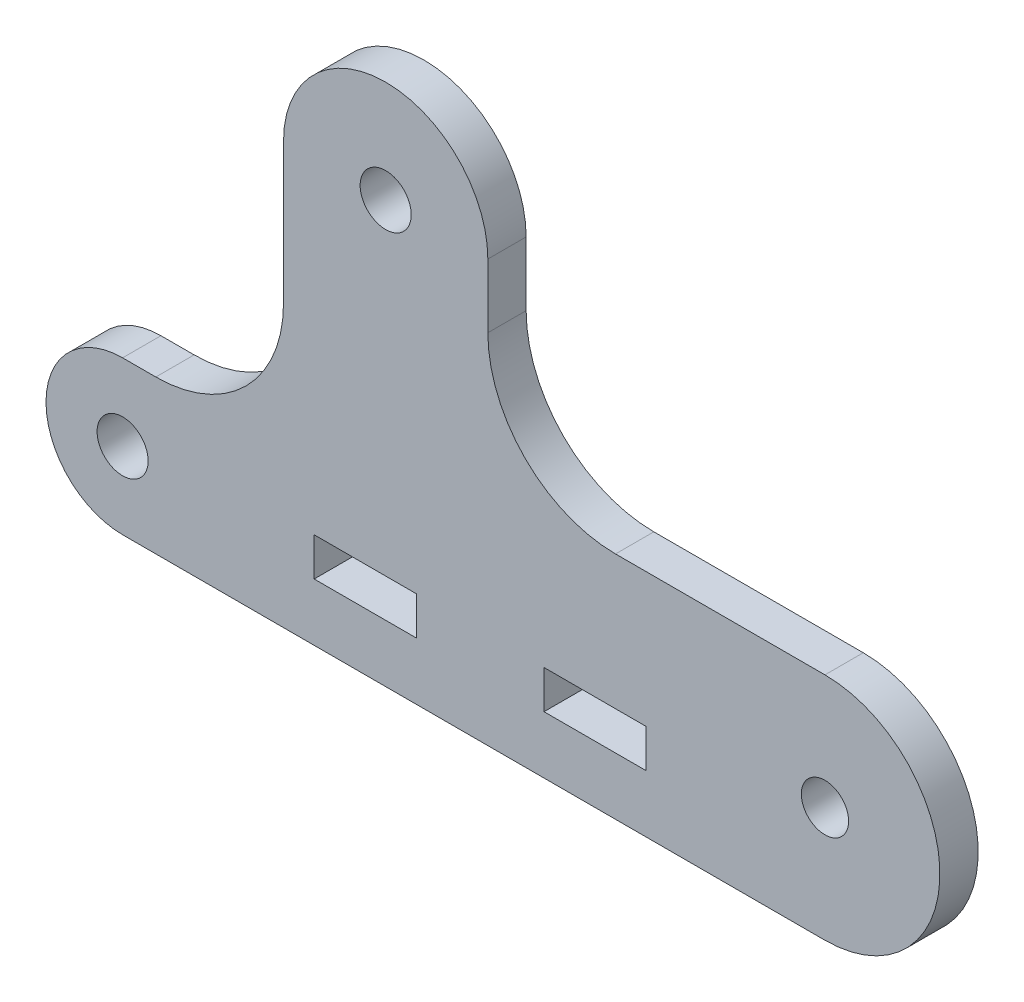
ISO-10303-21;
HEADER;
FILE_DESCRIPTION(('STEP AP214'),'2;1');
FILE_NAME('part.step','',(''),(''),'','','');
FILE_SCHEMA(('AUTOMOTIVE_DESIGN { 1 0 10303 214 1 1 1 1 }'));
ENDSEC;
DATA;
#1=APPLICATION_CONTEXT('core data for automotive mechanical design processes');
#2=APPLICATION_PROTOCOL_DEFINITION('international standard','automotive_design',2000,#1);
#3=PRODUCT_CONTEXT('',#1,'mechanical');
#4=PRODUCT('Part','Part','',(#3));
#5=PRODUCT_RELATED_PRODUCT_CATEGORY('part','',(#4));
#6=PRODUCT_DEFINITION_FORMATION('','',#4);
#7=PRODUCT_DEFINITION_CONTEXT('part definition',#1,'design');
#8=PRODUCT_DEFINITION('design','',#6,#7);
#9=PRODUCT_DEFINITION_SHAPE('','',#8);
#10=(LENGTH_UNIT() NAMED_UNIT(*) SI_UNIT(.MILLI.,.METRE.));
#11=(NAMED_UNIT(*) PLANE_ANGLE_UNIT() SI_UNIT($,.RADIAN.));
#12=(NAMED_UNIT(*) SI_UNIT($,.STERADIAN.) SOLID_ANGLE_UNIT());
#13=UNCERTAINTY_MEASURE_WITH_UNIT(LENGTH_MEASURE(1.E-05),#10,'distance_accuracy_value','');
#14=(GEOMETRIC_REPRESENTATION_CONTEXT(3) GLOBAL_UNCERTAINTY_ASSIGNED_CONTEXT((#13)) GLOBAL_UNIT_ASSIGNED_CONTEXT((#10,
#11,#12)) REPRESENTATION_CONTEXT('',''));
#15=CARTESIAN_POINT('',(0.,0.,0.));
#16=DIRECTION('',(0.,0.,1.));
#17=DIRECTION('',(1.,0.,0.));
#18=AXIS2_PLACEMENT_3D('',#15,#16,#17);
#19=CARTESIAN_POINT('',(-27.5,6.,1.5));
#20=DIRECTION('',(0.,0.,-1.));
#21=DIRECTION('',(-1.,0.,0.));
#22=AXIS2_PLACEMENT_3D('',#19,#20,#21);
#23=PLANE('',#22);
#24=DIRECTION('',(0.,-1.,0.));
#25=VECTOR('',#24,1.);
#26=CARTESIAN_POINT('',(-12.5,7.5,1.5));
#27=LINE('',#26,#25);
#28=CARTESIAN_POINT('',(-12.5,7.5,1.5));
#29=VERTEX_POINT('',#28);
#30=CARTESIAN_POINT('',(-12.5,4.5,1.5));
#31=VERTEX_POINT('',#30);
#32=EDGE_CURVE('E194',#29,#31,#27,.T.);
#33=ORIENTED_EDGE('',*,*,#32,.F.);
#34=DIRECTION('',(-1.,0.,0.));
#35=VECTOR('',#34,1.);
#36=CARTESIAN_POINT('',(-12.5,7.5,1.5));
#37=LINE('',#36,#35);
#38=CARTESIAN_POINT('',(-4.5,7.5,1.5));
#39=VERTEX_POINT('',#38);
#40=EDGE_CURVE('E202',#39,#29,#37,.T.);
#41=ORIENTED_EDGE('',*,*,#40,.F.);
#42=DIRECTION('',(0.,1.,0.));
#43=VECTOR('',#42,1.);
#44=CARTESIAN_POINT('',(-4.5,7.5,1.5));
#45=LINE('',#44,#43);
#46=CARTESIAN_POINT('',(-4.5,4.5,1.5));
#47=VERTEX_POINT('',#46);
#48=EDGE_CURVE('E199',#47,#39,#45,.T.);
#49=ORIENTED_EDGE('',*,*,#48,.F.);
#50=DIRECTION('',(1.,0.,0.));
#51=VECTOR('',#50,1.);
#52=CARTESIAN_POINT('',(-12.5,4.5,1.5));
#53=LINE('',#52,#51);
#54=EDGE_CURVE('E196',#31,#47,#53,.T.);
#55=ORIENTED_EDGE('',*,*,#54,.F.);
#56=EDGE_LOOP('',(#33,#41,#49,#55));
#57=FACE_BOUND('',#56,.T.);
#58=CARTESIAN_POINT('',(-27.5,6.,1.5));
#59=DIRECTION('',(0.,0.,1.));
#60=DIRECTION('',(-1.,0.,0.));
#61=AXIS2_PLACEMENT_3D('',#58,#59,#60);
#62=CIRCLE('',#61,6.);
#63=CARTESIAN_POINT('',(-27.5,12.,1.5));
#64=VERTEX_POINT('',#63);
#65=CARTESIAN_POINT('',(-27.5,0.,1.5));
#66=VERTEX_POINT('',#65);
#67=EDGE_CURVE('E243',#64,#66,#62,.T.);
#68=ORIENTED_EDGE('',*,*,#67,.T.);
#69=DIRECTION('',(1.,0.,0.));
#70=VECTOR('',#69,1.);
#71=CARTESIAN_POINT('',(-27.5,0.,1.5));
#72=LINE('',#71,#70);
#73=CARTESIAN_POINT('',(27.5,0.,1.5));
#74=VERTEX_POINT('',#73);
#75=EDGE_CURVE('E246',#66,#74,#72,.T.);
#76=ORIENTED_EDGE('',*,*,#75,.T.);
#77=CARTESIAN_POINT('',(27.5,9.,1.5));
#78=DIRECTION('',(0.,0.,1.));
#79=DIRECTION('',(1.,0.,0.));
#80=AXIS2_PLACEMENT_3D('',#77,#78,#79);
#81=CIRCLE('',#80,9.);
#82=CARTESIAN_POINT('',(27.5,18.,1.5));
#83=VERTEX_POINT('',#82);
#84=EDGE_CURVE('E249',#74,#83,#81,.T.);
#85=ORIENTED_EDGE('',*,*,#84,.T.);
#86=DIRECTION('',(-1.,0.,0.));
#87=VECTOR('',#86,1.);
#88=CARTESIAN_POINT('',(11.1000000000001,18.,1.5));
#89=LINE('',#88,#87);
#90=CARTESIAN_POINT('',(11.1000000000001,18.,1.5));
#91=VERTEX_POINT('',#90);
#92=EDGE_CURVE('E251',#83,#91,#89,.T.);
#93=ORIENTED_EDGE('',*,*,#92,.T.);
#94=CARTESIAN_POINT('',(11.1,28.,1.5));
#95=DIRECTION('',(0.,0.,-1.));
#96=DIRECTION('',(1.,0.,0.));
#97=AXIS2_PLACEMENT_3D('',#94,#95,#96);
#98=CIRCLE('',#97,10.);
#99=CARTESIAN_POINT('',(1.09999999999999,28.0000000000001,1.5));
#100=VERTEX_POINT('',#99);
#101=EDGE_CURVE('E253',#91,#100,#98,.T.);
#102=ORIENTED_EDGE('',*,*,#101,.T.);
#103=DIRECTION('',(0.,1.,0.));
#104=VECTOR('',#103,1.);
#105=CARTESIAN_POINT('',(1.09999999999999,33.,1.5));
#106=LINE('',#105,#104);
#107=CARTESIAN_POINT('',(1.09999999999999,33.,1.5));
#108=VERTEX_POINT('',#107);
#109=EDGE_CURVE('E255',#100,#108,#106,.T.);
#110=ORIENTED_EDGE('',*,*,#109,.T.);
#111=CARTESIAN_POINT('',(-6.90000000000001,33.,1.5));
#112=DIRECTION('',(0.,0.,1.));
#113=DIRECTION('',(-1.,0.,0.));
#114=AXIS2_PLACEMENT_3D('',#111,#112,#113);
#115=CIRCLE('',#114,8.);
#116=CARTESIAN_POINT('',(-14.9,33.,1.5));
#117=VERTEX_POINT('',#116);
#118=EDGE_CURVE('E257',#108,#117,#115,.T.);
#119=ORIENTED_EDGE('',*,*,#118,.T.);
#120=DIRECTION('',(0.,-1.,0.));
#121=VECTOR('',#120,1.);
#122=CARTESIAN_POINT('',(-14.9,33.,1.5));
#123=LINE('',#122,#121);
#124=CARTESIAN_POINT('',(-14.9,22.0000000000001,1.5));
#125=VERTEX_POINT('',#124);
#126=EDGE_CURVE('E259',#117,#125,#123,.T.);
#127=ORIENTED_EDGE('',*,*,#126,.T.);
#128=CARTESIAN_POINT('',(-24.9,22.,1.5));
#129=DIRECTION('',(0.,0.,-1.));
#130=DIRECTION('',(-1.,0.,0.));
#131=AXIS2_PLACEMENT_3D('',#128,#129,#130);
#132=CIRCLE('',#131,10.);
#133=CARTESIAN_POINT('',(-24.9000000000001,12.,1.5));
#134=VERTEX_POINT('',#133);
#135=EDGE_CURVE('E261',#125,#134,#132,.T.);
#136=ORIENTED_EDGE('',*,*,#135,.T.);
#137=DIRECTION('',(-1.,0.,0.));
#138=VECTOR('',#137,1.);
#139=CARTESIAN_POINT('',(-24.9000000000001,12.,1.5));
#140=LINE('',#139,#138);
#141=EDGE_CURVE('E263',#134,#64,#140,.T.);
#142=ORIENTED_EDGE('',*,*,#141,.T.);
#143=EDGE_LOOP('',(#68,#76,#85,#93,#102,#110,#119,#127,#136,#142));
#144=FACE_BOUND('',#143,.T.);
#145=CARTESIAN_POINT('',(27.5,9.,1.5));
#146=DIRECTION('',(0.,0.,1.));
#147=DIRECTION('',(1.,0.,0.));
#148=AXIS2_PLACEMENT_3D('',#145,#146,#147);
#149=CIRCLE('',#148,1.85);
#150=CARTESIAN_POINT('',(29.35,9.,1.5));
#151=VERTEX_POINT('',#150);
#152=EDGE_CURVE('E237',#151,#151,#149,.T.);
#153=ORIENTED_EDGE('',*,*,#152,.F.);
#154=EDGE_LOOP('',(#153));
#155=FACE_BOUND('',#154,.T.);
#156=CARTESIAN_POINT('',(-27.5,6.,1.5));
#157=DIRECTION('',(0.,0.,1.));
#158=DIRECTION('',(1.,0.,0.));
#159=AXIS2_PLACEMENT_3D('',#156,#157,#158);
#160=CIRCLE('',#159,2.);
#161=CARTESIAN_POINT('',(-25.5,6.,1.5));
#162=VERTEX_POINT('',#161);
#163=EDGE_CURVE('E231',#162,#162,#160,.T.);
#164=ORIENTED_EDGE('',*,*,#163,.F.);
#165=EDGE_LOOP('',(#164));
#166=FACE_BOUND('',#165,.T.);
#167=CARTESIAN_POINT('',(-6.90000000000001,33.,1.5));
#168=DIRECTION('',(0.,0.,1.));
#169=DIRECTION('',(1.,0.,0.));
#170=AXIS2_PLACEMENT_3D('',#167,#168,#169);
#171=CIRCLE('',#170,2.);
#172=CARTESIAN_POINT('',(-4.90000000000001,33.,1.5));
#173=VERTEX_POINT('',#172);
#174=EDGE_CURVE('E225',#173,#173,#171,.T.);
#175=ORIENTED_EDGE('',*,*,#174,.F.);
#176=EDGE_LOOP('',(#175));
#177=FACE_BOUND('',#176,.T.);
#178=DIRECTION('',(0.,-1.,0.));
#179=VECTOR('',#178,1.);
#180=CARTESIAN_POINT('',(5.5,7.5,1.5));
#181=LINE('',#180,#179);
#182=CARTESIAN_POINT('',(5.5,7.5,1.5));
#183=VERTEX_POINT('',#182);
#184=CARTESIAN_POINT('',(5.5,4.5,1.5));
#185=VERTEX_POINT('',#184);
#186=EDGE_CURVE('E158',#183,#185,#181,.T.);
#187=ORIENTED_EDGE('',*,*,#186,.F.);
#188=DIRECTION('',(-1.,0.,0.));
#189=VECTOR('',#188,1.);
#190=CARTESIAN_POINT('',(5.5,7.5,1.5));
#191=LINE('',#190,#189);
#192=CARTESIAN_POINT('',(13.5,7.5,1.5));
#193=VERTEX_POINT('',#192);
#194=EDGE_CURVE('E180',#193,#183,#191,.T.);
#195=ORIENTED_EDGE('',*,*,#194,.F.);
#196=DIRECTION('',(0.,1.,0.));
#197=VECTOR('',#196,1.);
#198=CARTESIAN_POINT('',(13.5,7.5,1.5));
#199=LINE('',#198,#197);
#200=CARTESIAN_POINT('',(13.5,4.5,1.5));
#201=VERTEX_POINT('',#200);
#202=EDGE_CURVE('E178',#201,#193,#199,.T.);
#203=ORIENTED_EDGE('',*,*,#202,.F.);
#204=DIRECTION('',(1.,0.,0.));
#205=VECTOR('',#204,1.);
#206=CARTESIAN_POINT('',(5.5,4.5,1.5));
#207=LINE('',#206,#205);
#208=EDGE_CURVE('E166',#185,#201,#207,.T.);
#209=ORIENTED_EDGE('',*,*,#208,.F.);
#210=EDGE_LOOP('',(#187,#195,#203,#209));
#211=FACE_BOUND('',#210,.T.);
#212=ADVANCED_FACE('F33',(#57,#144,#155,#166,#177,#211),#23,.F.);
#213=CARTESIAN_POINT('',(-27.5,6.,-1.5));
#214=DIRECTION('',(0.,0.,-1.));
#215=DIRECTION('',(-1.,0.,0.));
#216=AXIS2_PLACEMENT_3D('',#213,#214,#215);
#217=PLANE('',#216);
#218=CARTESIAN_POINT('',(-27.5,6.,-1.5));
#219=DIRECTION('',(0.,0.,1.));
#220=DIRECTION('',(1.,0.,0.));
#221=AXIS2_PLACEMENT_3D('',#218,#219,#220);
#222=CIRCLE('',#221,2.);
#223=CARTESIAN_POINT('',(-25.5,6.,-1.5));
#224=VERTEX_POINT('',#223);
#225=EDGE_CURVE('E228',#224,#224,#222,.T.);
#226=ORIENTED_EDGE('',*,*,#225,.T.);
#227=EDGE_LOOP('',(#226));
#228=FACE_BOUND('',#227,.T.);
#229=CARTESIAN_POINT('',(-27.5,6.,-1.5));
#230=DIRECTION('',(0.,0.,1.));
#231=DIRECTION('',(-1.,0.,0.));
#232=AXIS2_PLACEMENT_3D('',#229,#230,#231);
#233=CIRCLE('',#232,6.);
#234=CARTESIAN_POINT('',(-27.5,12.,-1.5));
#235=VERTEX_POINT('',#234);
#236=CARTESIAN_POINT('',(-27.5,0.,-1.5));
#237=VERTEX_POINT('',#236);
#238=EDGE_CURVE('E240',#235,#237,#233,.T.);
#239=ORIENTED_EDGE('',*,*,#238,.F.);
#240=DIRECTION('',(-1.,0.,0.));
#241=VECTOR('',#240,1.);
#242=CARTESIAN_POINT('',(-24.9000000000001,12.,-1.5));
#243=LINE('',#242,#241);
#244=CARTESIAN_POINT('',(-24.9000000000001,12.,-1.5));
#245=VERTEX_POINT('',#244);
#246=EDGE_CURVE('E247',#245,#235,#243,.T.);
#247=ORIENTED_EDGE('',*,*,#246,.F.);
#248=CARTESIAN_POINT('',(-24.9,22.,-1.5));
#249=DIRECTION('',(0.,0.,-1.));
#250=DIRECTION('',(-1.,0.,0.));
#251=AXIS2_PLACEMENT_3D('',#248,#249,#250);
#252=CIRCLE('',#251,10.);
#253=CARTESIAN_POINT('',(-14.9,22.0000000000001,-1.5));
#254=VERTEX_POINT('',#253);
#255=EDGE_CURVE('E282',#254,#245,#252,.T.);
#256=ORIENTED_EDGE('',*,*,#255,.F.);
#257=DIRECTION('',(0.,-1.,0.));
#258=VECTOR('',#257,1.);
#259=CARTESIAN_POINT('',(-14.9,33.,-1.5));
#260=LINE('',#259,#258);
#261=CARTESIAN_POINT('',(-14.9,33.,-1.5));
#262=VERTEX_POINT('',#261);
#263=EDGE_CURVE('E280',#262,#254,#260,.T.);
#264=ORIENTED_EDGE('',*,*,#263,.F.);
#265=CARTESIAN_POINT('',(-6.90000000000001,33.,-1.5));
#266=DIRECTION('',(0.,0.,1.));
#267=DIRECTION('',(-1.,0.,0.));
#268=AXIS2_PLACEMENT_3D('',#265,#266,#267);
#269=CIRCLE('',#268,8.);
#270=CARTESIAN_POINT('',(1.09999999999999,33.,-1.5));
#271=VERTEX_POINT('',#270);
#272=EDGE_CURVE('E278',#271,#262,#269,.T.);
#273=ORIENTED_EDGE('',*,*,#272,.F.);
#274=DIRECTION('',(0.,1.,0.));
#275=VECTOR('',#274,1.);
#276=CARTESIAN_POINT('',(1.09999999999999,33.,-1.5));
#277=LINE('',#276,#275);
#278=CARTESIAN_POINT('',(1.09999999999999,28.0000000000001,-1.5));
#279=VERTEX_POINT('',#278);
#280=EDGE_CURVE('E276',#279,#271,#277,.T.);
#281=ORIENTED_EDGE('',*,*,#280,.F.);
#282=CARTESIAN_POINT('',(11.1,28.,-1.5));
#283=DIRECTION('',(0.,0.,-1.));
#284=DIRECTION('',(1.,0.,0.));
#285=AXIS2_PLACEMENT_3D('',#282,#283,#284);
#286=CIRCLE('',#285,10.);
#287=CARTESIAN_POINT('',(11.1000000000001,18.,-1.5));
#288=VERTEX_POINT('',#287);
#289=EDGE_CURVE('E274',#288,#279,#286,.T.);
#290=ORIENTED_EDGE('',*,*,#289,.F.);
#291=DIRECTION('',(-1.,0.,0.));
#292=VECTOR('',#291,1.);
#293=CARTESIAN_POINT('',(11.1000000000001,18.,-1.5));
#294=LINE('',#293,#292);
#295=CARTESIAN_POINT('',(27.5,18.,-1.5));
#296=VERTEX_POINT('',#295);
#297=EDGE_CURVE('E272',#296,#288,#294,.T.);
#298=ORIENTED_EDGE('',*,*,#297,.F.);
#299=CARTESIAN_POINT('',(27.5,9.,-1.5));
#300=DIRECTION('',(0.,0.,1.));
#301=DIRECTION('',(1.,0.,0.));
#302=AXIS2_PLACEMENT_3D('',#299,#300,#301);
#303=CIRCLE('',#302,9.);
#304=CARTESIAN_POINT('',(27.5,0.,-1.5));
#305=VERTEX_POINT('',#304);
#306=EDGE_CURVE('E270',#305,#296,#303,.T.);
#307=ORIENTED_EDGE('',*,*,#306,.F.);
#308=DIRECTION('',(1.,0.,0.));
#309=VECTOR('',#308,1.);
#310=CARTESIAN_POINT('',(-27.5,0.,-1.5));
#311=LINE('',#310,#309);
#312=EDGE_CURVE('E268',#237,#305,#311,.T.);
#313=ORIENTED_EDGE('',*,*,#312,.F.);
#314=EDGE_LOOP('',(#239,#247,#256,#264,#273,#281,#290,#298,#307,#313));
#315=FACE_BOUND('',#314,.T.);
#316=CARTESIAN_POINT('',(27.5,9.,-1.5));
#317=DIRECTION('',(0.,0.,1.));
#318=DIRECTION('',(1.,0.,0.));
#319=AXIS2_PLACEMENT_3D('',#316,#317,#318);
#320=CIRCLE('',#319,1.85);
#321=CARTESIAN_POINT('',(29.35,9.,-1.5));
#322=VERTEX_POINT('',#321);
#323=EDGE_CURVE('E234',#322,#322,#320,.T.);
#324=ORIENTED_EDGE('',*,*,#323,.T.);
#325=EDGE_LOOP('',(#324));
#326=FACE_BOUND('',#325,.T.);
#327=CARTESIAN_POINT('',(-6.90000000000001,33.,-1.5));
#328=DIRECTION('',(0.,0.,1.));
#329=DIRECTION('',(1.,0.,0.));
#330=AXIS2_PLACEMENT_3D('',#327,#328,#329);
#331=CIRCLE('',#330,2.);
#332=CARTESIAN_POINT('',(-4.90000000000001,33.,-1.5));
#333=VERTEX_POINT('',#332);
#334=EDGE_CURVE('E224',#333,#333,#331,.T.);
#335=ORIENTED_EDGE('',*,*,#334,.T.);
#336=EDGE_LOOP('',(#335));
#337=FACE_BOUND('',#336,.T.);
#338=DIRECTION('',(-1.,0.,0.));
#339=VECTOR('',#338,1.);
#340=CARTESIAN_POINT('',(-12.5,7.5,-1.5));
#341=LINE('',#340,#339);
#342=CARTESIAN_POINT('',(-4.5,7.5,-1.5));
#343=VERTEX_POINT('',#342);
#344=CARTESIAN_POINT('',(-12.5,7.5,-1.5));
#345=VERTEX_POINT('',#344);
#346=EDGE_CURVE('E197',#343,#345,#341,.T.);
#347=ORIENTED_EDGE('',*,*,#346,.T.);
#348=DIRECTION('',(0.,-1.,0.));
#349=VECTOR('',#348,1.);
#350=CARTESIAN_POINT('',(-12.5,7.5,-1.5));
#351=LINE('',#350,#349);
#352=CARTESIAN_POINT('',(-12.5,4.5,-1.5));
#353=VERTEX_POINT('',#352);
#354=EDGE_CURVE('E174',#345,#353,#351,.T.);
#355=ORIENTED_EDGE('',*,*,#354,.T.);
#356=DIRECTION('',(1.,0.,0.));
#357=VECTOR('',#356,1.);
#358=CARTESIAN_POINT('',(-12.5,4.5,-1.5));
#359=LINE('',#358,#357);
#360=CARTESIAN_POINT('',(-4.5,4.5,-1.5));
#361=VERTEX_POINT('',#360);
#362=EDGE_CURVE('E207',#353,#361,#359,.T.);
#363=ORIENTED_EDGE('',*,*,#362,.T.);
#364=DIRECTION('',(0.,1.,0.));
#365=VECTOR('',#364,1.);
#366=CARTESIAN_POINT('',(-4.5,7.5,-1.5));
#367=LINE('',#366,#365);
#368=EDGE_CURVE('E210',#361,#343,#367,.T.);
#369=ORIENTED_EDGE('',*,*,#368,.T.);
#370=EDGE_LOOP('',(#347,#355,#363,#369));
#371=FACE_BOUND('',#370,.T.);
#372=DIRECTION('',(-1.,0.,0.));
#373=VECTOR('',#372,1.);
#374=CARTESIAN_POINT('',(5.5,7.5,-1.5));
#375=LINE('',#374,#373);
#376=CARTESIAN_POINT('',(13.5,7.5,-1.5));
#377=VERTEX_POINT('',#376);
#378=CARTESIAN_POINT('',(5.5,7.5,-1.5));
#379=VERTEX_POINT('',#378);
#380=EDGE_CURVE('E167',#377,#379,#375,.T.);
#381=ORIENTED_EDGE('',*,*,#380,.T.);
#382=DIRECTION('',(0.,-1.,0.));
#383=VECTOR('',#382,1.);
#384=CARTESIAN_POINT('',(5.5,7.5,-1.5));
#385=LINE('',#384,#383);
#386=CARTESIAN_POINT('',(5.5,4.5,-1.5));
#387=VERTEX_POINT('',#386);
#388=EDGE_CURVE('E56',#379,#387,#385,.T.);
#389=ORIENTED_EDGE('',*,*,#388,.T.);
#390=DIRECTION('',(1.,0.,0.));
#391=VECTOR('',#390,1.);
#392=CARTESIAN_POINT('',(5.5,4.5,-1.5));
#393=LINE('',#392,#391);
#394=CARTESIAN_POINT('',(13.5,4.5,-1.5));
#395=VERTEX_POINT('',#394);
#396=EDGE_CURVE('E173',#387,#395,#393,.T.);
#397=ORIENTED_EDGE('',*,*,#396,.T.);
#398=DIRECTION('',(0.,1.,0.));
#399=VECTOR('',#398,1.);
#400=CARTESIAN_POINT('',(13.5,7.5,-1.5));
#401=LINE('',#400,#399);
#402=EDGE_CURVE('E186',#395,#377,#401,.T.);
#403=ORIENTED_EDGE('',*,*,#402,.T.);
#404=EDGE_LOOP('',(#381,#389,#397,#403));
#405=FACE_BOUND('',#404,.T.);
#406=ADVANCED_FACE('F318',(#228,#315,#326,#337,#371,#405),#217,.T.);
#407=CARTESIAN_POINT('',(-27.5,6.,1.5));
#408=DIRECTION('',(0.,0.,-1.));
#409=DIRECTION('',(-1.,0.,0.));
#410=AXIS2_PLACEMENT_3D('',#407,#408,#409);
#411=CYLINDRICAL_SURFACE('',#410,6.);
#412=ORIENTED_EDGE('',*,*,#238,.T.);
#413=DIRECTION('',(0.,0.,-1.));
#414=VECTOR('',#413,1.);
#415=CARTESIAN_POINT('',(-27.5,0.,1.5));
#416=LINE('',#415,#414);
#417=EDGE_CURVE('E11',#66,#237,#416,.T.);
#418=ORIENTED_EDGE('',*,*,#417,.F.);
#419=ORIENTED_EDGE('',*,*,#67,.F.);
#420=DIRECTION('',(0.,0.,-1.));
#421=VECTOR('',#420,1.);
#422=CARTESIAN_POINT('',(-27.5,12.,1.5));
#423=LINE('',#422,#421);
#424=EDGE_CURVE('E265',#64,#235,#423,.T.);
#425=ORIENTED_EDGE('',*,*,#424,.T.);
#426=EDGE_LOOP('',(#412,#418,#419,#425));
#427=FACE_BOUND('',#426,.T.);
#428=ADVANCED_FACE('F35',(#427),#411,.T.);
#429=CARTESIAN_POINT('',(-27.5,0.,1.5));
#430=DIRECTION('',(0.,1.,0.));
#431=DIRECTION('',(0.,0.,1.));
#432=AXIS2_PLACEMENT_3D('',#429,#430,#431);
#433=PLANE('',#432);
#434=ORIENTED_EDGE('',*,*,#312,.T.);
#435=DIRECTION('',(0.,0.,-1.));
#436=VECTOR('',#435,1.);
#437=CARTESIAN_POINT('',(27.5,0.,1.5));
#438=LINE('',#437,#436);
#439=EDGE_CURVE('E41',#74,#305,#438,.T.);
#440=ORIENTED_EDGE('',*,*,#439,.F.);
#441=ORIENTED_EDGE('',*,*,#75,.F.);
#442=ORIENTED_EDGE('',*,*,#417,.T.);
#443=EDGE_LOOP('',(#434,#440,#441,#442));
#444=FACE_BOUND('',#443,.T.);
#445=ADVANCED_FACE('F336',(#444),#433,.F.);
#446=CARTESIAN_POINT('',(27.5,9.,1.5));
#447=DIRECTION('',(0.,0.,-1.));
#448=DIRECTION('',(-1.,0.,0.));
#449=AXIS2_PLACEMENT_3D('',#446,#447,#448);
#450=CYLINDRICAL_SURFACE('',#449,9.);
#451=ORIENTED_EDGE('',*,*,#306,.T.);
#452=DIRECTION('',(0.,0.,-1.));
#453=VECTOR('',#452,1.);
#454=CARTESIAN_POINT('',(27.5,18.,1.5));
#455=LINE('',#454,#453);
#456=EDGE_CURVE('E305',#83,#296,#455,.T.);
#457=ORIENTED_EDGE('',*,*,#456,.F.);
#458=ORIENTED_EDGE('',*,*,#84,.F.);
#459=ORIENTED_EDGE('',*,*,#439,.T.);
#460=EDGE_LOOP('',(#451,#457,#458,#459));
#461=FACE_BOUND('',#460,.T.);
#462=ADVANCED_FACE('F312',(#461),#450,.T.);
#463=CARTESIAN_POINT('',(11.1000000000001,18.,1.5));
#464=DIRECTION('',(0.,-1.,0.));
#465=DIRECTION('',(0.,0.,-1.));
#466=AXIS2_PLACEMENT_3D('',#463,#464,#465);
#467=PLANE('',#466);
#468=ORIENTED_EDGE('',*,*,#297,.T.);
#469=DIRECTION('',(0.,0.,-1.));
#470=VECTOR('',#469,1.);
#471=CARTESIAN_POINT('',(11.1000000000001,18.,1.5));
#472=LINE('',#471,#470);
#473=EDGE_CURVE('E302',#91,#288,#472,.T.);
#474=ORIENTED_EDGE('',*,*,#473,.F.);
#475=ORIENTED_EDGE('',*,*,#92,.F.);
#476=ORIENTED_EDGE('',*,*,#456,.T.);
#477=EDGE_LOOP('',(#468,#474,#475,#476));
#478=FACE_BOUND('',#477,.T.);
#479=ADVANCED_FACE('F324',(#478),#467,.F.);
#480=CARTESIAN_POINT('',(11.1,28.,1.5));
#481=DIRECTION('',(0.,0.,-1.));
#482=DIRECTION('',(-1.,0.,0.));
#483=AXIS2_PLACEMENT_3D('',#480,#481,#482);
#484=CYLINDRICAL_SURFACE('',#483,10.);
#485=ORIENTED_EDGE('',*,*,#289,.T.);
#486=DIRECTION('',(0.,0.,-1.));
#487=VECTOR('',#486,1.);
#488=CARTESIAN_POINT('',(1.09999999999999,28.0000000000001,1.5));
#489=LINE('',#488,#487);
#490=EDGE_CURVE('E299',#100,#279,#489,.T.);
#491=ORIENTED_EDGE('',*,*,#490,.F.);
#492=ORIENTED_EDGE('',*,*,#101,.F.);
#493=ORIENTED_EDGE('',*,*,#473,.T.);
#494=EDGE_LOOP('',(#485,#491,#492,#493));
#495=FACE_BOUND('',#494,.T.);
#496=ADVANCED_FACE('F328',(#495),#484,.F.);
#497=CARTESIAN_POINT('',(1.09999999999999,33.,1.5));
#498=DIRECTION('',(-1.,0.,0.));
#499=DIRECTION('',(0.,0.,1.));
#500=AXIS2_PLACEMENT_3D('',#497,#498,#499);
#501=PLANE('',#500);
#502=ORIENTED_EDGE('',*,*,#280,.T.);
#503=DIRECTION('',(0.,0.,-1.));
#504=VECTOR('',#503,1.);
#505=CARTESIAN_POINT('',(1.09999999999999,33.,1.5));
#506=LINE('',#505,#504);
#507=EDGE_CURVE('E296',#108,#271,#506,.T.);
#508=ORIENTED_EDGE('',*,*,#507,.F.);
#509=ORIENTED_EDGE('',*,*,#109,.F.);
#510=ORIENTED_EDGE('',*,*,#490,.T.);
#511=EDGE_LOOP('',(#502,#508,#509,#510));
#512=FACE_BOUND('',#511,.T.);
#513=ADVANCED_FACE('F359',(#512),#501,.F.);
#514=CARTESIAN_POINT('',(-6.90000000000001,33.,1.5));
#515=DIRECTION('',(0.,0.,-1.));
#516=DIRECTION('',(-1.,0.,0.));
#517=AXIS2_PLACEMENT_3D('',#514,#515,#516);
#518=CYLINDRICAL_SURFACE('',#517,8.);
#519=ORIENTED_EDGE('',*,*,#272,.T.);
#520=DIRECTION('',(0.,0.,-1.));
#521=VECTOR('',#520,1.);
#522=CARTESIAN_POINT('',(-14.9,33.,1.5));
#523=LINE('',#522,#521);
#524=EDGE_CURVE('E293',#117,#262,#523,.T.);
#525=ORIENTED_EDGE('',*,*,#524,.F.);
#526=ORIENTED_EDGE('',*,*,#118,.F.);
#527=ORIENTED_EDGE('',*,*,#507,.T.);
#528=EDGE_LOOP('',(#519,#525,#526,#527));
#529=FACE_BOUND('',#528,.T.);
#530=ADVANCED_FACE('F356',(#529),#518,.T.);
#531=CARTESIAN_POINT('',(-14.9,33.,1.5));
#532=DIRECTION('',(1.,0.,0.));
#533=DIRECTION('',(0.,0.,-1.));
#534=AXIS2_PLACEMENT_3D('',#531,#532,#533);
#535=PLANE('',#534);
#536=ORIENTED_EDGE('',*,*,#263,.T.);
#537=DIRECTION('',(0.,0.,-1.));
#538=VECTOR('',#537,1.);
#539=CARTESIAN_POINT('',(-14.9,22.0000000000001,1.5));
#540=LINE('',#539,#538);
#541=EDGE_CURVE('E290',#125,#254,#540,.T.);
#542=ORIENTED_EDGE('',*,*,#541,.F.);
#543=ORIENTED_EDGE('',*,*,#126,.F.);
#544=ORIENTED_EDGE('',*,*,#524,.T.);
#545=EDGE_LOOP('',(#536,#542,#543,#544));
#546=FACE_BOUND('',#545,.T.);
#547=ADVANCED_FACE('F352',(#546),#535,.F.);
#548=CARTESIAN_POINT('',(-24.9,22.,1.5));
#549=DIRECTION('',(0.,0.,-1.));
#550=DIRECTION('',(-1.,0.,0.));
#551=AXIS2_PLACEMENT_3D('',#548,#549,#550);
#552=CYLINDRICAL_SURFACE('',#551,10.);
#553=ORIENTED_EDGE('',*,*,#255,.T.);
#554=DIRECTION('',(0.,0.,-1.));
#555=VECTOR('',#554,1.);
#556=CARTESIAN_POINT('',(-24.9000000000001,12.,1.5));
#557=LINE('',#556,#555);
#558=EDGE_CURVE('E287',#134,#245,#557,.T.);
#559=ORIENTED_EDGE('',*,*,#558,.F.);
#560=ORIENTED_EDGE('',*,*,#135,.F.);
#561=ORIENTED_EDGE('',*,*,#541,.T.);
#562=EDGE_LOOP('',(#553,#559,#560,#561));
#563=FACE_BOUND('',#562,.T.);
#564=ADVANCED_FACE('F348',(#563),#552,.F.);
#565=CARTESIAN_POINT('',(-24.9000000000001,12.,1.5));
#566=DIRECTION('',(0.,-1.,0.));
#567=DIRECTION('',(0.,0.,-1.));
#568=AXIS2_PLACEMENT_3D('',#565,#566,#567);
#569=PLANE('',#568);
#570=ORIENTED_EDGE('',*,*,#246,.T.);
#571=ORIENTED_EDGE('',*,*,#424,.F.);
#572=ORIENTED_EDGE('',*,*,#141,.F.);
#573=ORIENTED_EDGE('',*,*,#558,.T.);
#574=EDGE_LOOP('',(#570,#571,#572,#573));
#575=FACE_BOUND('',#574,.T.);
#576=ADVANCED_FACE('F343',(#575),#569,.F.);
#577=CARTESIAN_POINT('',(27.5,9.,1.5));
#578=DIRECTION('',(0.,0.,-1.));
#579=DIRECTION('',(-1.,0.,0.));
#580=AXIS2_PLACEMENT_3D('',#577,#578,#579);
#581=CYLINDRICAL_SURFACE('',#580,1.85);
#582=ORIENTED_EDGE('',*,*,#152,.T.);
#583=EDGE_LOOP('',(#582));
#584=FACE_BOUND('',#583,.T.);
#585=ORIENTED_EDGE('',*,*,#323,.F.);
#586=EDGE_LOOP('',(#585));
#587=FACE_BOUND('',#586,.T.);
#588=ADVANCED_FACE('F378',(#584,#587),#581,.F.);
#589=CARTESIAN_POINT('',(-27.5,6.,1.5));
#590=DIRECTION('',(0.,0.,-1.));
#591=DIRECTION('',(-1.,0.,0.));
#592=AXIS2_PLACEMENT_3D('',#589,#590,#591);
#593=CYLINDRICAL_SURFACE('',#592,2.);
#594=ORIENTED_EDGE('',*,*,#163,.T.);
#595=EDGE_LOOP('',(#594));
#596=FACE_BOUND('',#595,.T.);
#597=ORIENTED_EDGE('',*,*,#225,.F.);
#598=EDGE_LOOP('',(#597));
#599=FACE_BOUND('',#598,.T.);
#600=ADVANCED_FACE('F404',(#596,#599),#593,.F.);
#601=CARTESIAN_POINT('',(-6.90000000000001,33.,1.5));
#602=DIRECTION('',(0.,0.,-1.));
#603=DIRECTION('',(-1.,0.,0.));
#604=AXIS2_PLACEMENT_3D('',#601,#602,#603);
#605=CYLINDRICAL_SURFACE('',#604,2.);
#606=ORIENTED_EDGE('',*,*,#174,.T.);
#607=EDGE_LOOP('',(#606));
#608=FACE_BOUND('',#607,.T.);
#609=ORIENTED_EDGE('',*,*,#334,.F.);
#610=EDGE_LOOP('',(#609));
#611=FACE_BOUND('',#610,.T.);
#612=ADVANCED_FACE('F411',(#608,#611),#605,.F.);
#613=CARTESIAN_POINT('',(-12.5,7.5,1.5));
#614=DIRECTION('',(1.,0.,0.));
#615=DIRECTION('',(0.,0.,-1.));
#616=AXIS2_PLACEMENT_3D('',#613,#614,#615);
#617=PLANE('',#616);
#618=ORIENTED_EDGE('',*,*,#354,.F.);
#619=DIRECTION('',(0.,0.,-1.));
#620=VECTOR('',#619,1.);
#621=CARTESIAN_POINT('',(-12.5,7.5,1.5));
#622=LINE('',#621,#620);
#623=EDGE_CURVE('E204',#29,#345,#622,.T.);
#624=ORIENTED_EDGE('',*,*,#623,.F.);
#625=ORIENTED_EDGE('',*,*,#32,.T.);
#626=DIRECTION('',(0.,0.,-1.));
#627=VECTOR('',#626,1.);
#628=CARTESIAN_POINT('',(-12.5,4.5,1.5));
#629=LINE('',#628,#627);
#630=EDGE_CURVE('E221',#31,#353,#629,.T.);
#631=ORIENTED_EDGE('',*,*,#630,.T.);
#632=EDGE_LOOP('',(#618,#624,#625,#631));
#633=FACE_BOUND('',#632,.T.);
#634=ADVANCED_FACE('F418',(#633),#617,.T.);
#635=CARTESIAN_POINT('',(-12.5,4.5,1.5));
#636=DIRECTION('',(0.,1.,0.));
#637=DIRECTION('',(0.,0.,1.));
#638=AXIS2_PLACEMENT_3D('',#635,#636,#637);
#639=PLANE('',#638);
#640=ORIENTED_EDGE('',*,*,#362,.F.);
#641=ORIENTED_EDGE('',*,*,#630,.F.);
#642=ORIENTED_EDGE('',*,*,#54,.T.);
#643=DIRECTION('',(0.,0.,-1.));
#644=VECTOR('',#643,1.);
#645=CARTESIAN_POINT('',(-4.5,4.5,1.5));
#646=LINE('',#645,#644);
#647=EDGE_CURVE('E219',#47,#361,#646,.T.);
#648=ORIENTED_EDGE('',*,*,#647,.T.);
#649=EDGE_LOOP('',(#640,#641,#642,#648));
#650=FACE_BOUND('',#649,.T.);
#651=ADVANCED_FACE('F426',(#650),#639,.T.);
#652=CARTESIAN_POINT('',(-4.5,7.5,1.5));
#653=DIRECTION('',(-1.,0.,0.));
#654=DIRECTION('',(0.,-1.,0.));
#655=AXIS2_PLACEMENT_3D('',#652,#653,#654);
#656=PLANE('',#655);
#657=ORIENTED_EDGE('',*,*,#368,.F.);
#658=ORIENTED_EDGE('',*,*,#647,.F.);
#659=ORIENTED_EDGE('',*,*,#48,.T.);
#660=DIRECTION('',(0.,0.,-1.));
#661=VECTOR('',#660,1.);
#662=CARTESIAN_POINT('',(-4.5,7.5,1.5));
#663=LINE('',#662,#661);
#664=EDGE_CURVE('E217',#39,#343,#663,.T.);
#665=ORIENTED_EDGE('',*,*,#664,.T.);
#666=EDGE_LOOP('',(#657,#658,#659,#665));
#667=FACE_BOUND('',#666,.T.);
#668=ADVANCED_FACE('F434',(#667),#656,.T.);
#669=CARTESIAN_POINT('',(-12.5,7.5,1.5));
#670=DIRECTION('',(0.,-1.,0.));
#671=DIRECTION('',(1.,0.,0.));
#672=AXIS2_PLACEMENT_3D('',#669,#670,#671);
#673=PLANE('',#672);
#674=ORIENTED_EDGE('',*,*,#346,.F.);
#675=ORIENTED_EDGE('',*,*,#664,.F.);
#676=ORIENTED_EDGE('',*,*,#40,.T.);
#677=ORIENTED_EDGE('',*,*,#623,.T.);
#678=EDGE_LOOP('',(#674,#675,#676,#677));
#679=FACE_BOUND('',#678,.T.);
#680=ADVANCED_FACE('F442',(#679),#673,.T.);
#681=CARTESIAN_POINT('',(5.5,7.5,1.5));
#682=DIRECTION('',(1.,0.,0.));
#683=DIRECTION('',(0.,0.,-1.));
#684=AXIS2_PLACEMENT_3D('',#681,#682,#683);
#685=PLANE('',#684);
#686=ORIENTED_EDGE('',*,*,#388,.F.);
#687=DIRECTION('',(0.,0.,-1.));
#688=VECTOR('',#687,1.);
#689=CARTESIAN_POINT('',(5.5,7.5,1.5));
#690=LINE('',#689,#688);
#691=EDGE_CURVE('E162',#183,#379,#690,.T.);
#692=ORIENTED_EDGE('',*,*,#691,.F.);
#693=ORIENTED_EDGE('',*,*,#186,.T.);
#694=DIRECTION('',(0.,0.,-1.));
#695=VECTOR('',#694,1.);
#696=CARTESIAN_POINT('',(5.5,4.5,1.5));
#697=LINE('',#696,#695);
#698=EDGE_CURVE('E161',#185,#387,#697,.T.);
#699=ORIENTED_EDGE('',*,*,#698,.T.);
#700=EDGE_LOOP('',(#686,#692,#693,#699));
#701=FACE_BOUND('',#700,.T.);
#702=ADVANCED_FACE('F160',(#701),#685,.T.);
#703=CARTESIAN_POINT('',(5.5,4.5,1.5));
#704=DIRECTION('',(0.,1.,0.));
#705=DIRECTION('',(0.,0.,1.));
#706=AXIS2_PLACEMENT_3D('',#703,#704,#705);
#707=PLANE('',#706);
#708=ORIENTED_EDGE('',*,*,#396,.F.);
#709=ORIENTED_EDGE('',*,*,#698,.F.);
#710=ORIENTED_EDGE('',*,*,#208,.T.);
#711=DIRECTION('',(0.,0.,-1.));
#712=VECTOR('',#711,1.);
#713=CARTESIAN_POINT('',(13.5,4.5,1.5));
#714=LINE('',#713,#712);
#715=EDGE_CURVE('E175',#201,#395,#714,.T.);
#716=ORIENTED_EDGE('',*,*,#715,.T.);
#717=EDGE_LOOP('',(#708,#709,#710,#716));
#718=FACE_BOUND('',#717,.T.);
#719=ADVANCED_FACE('F170',(#718),#707,.T.);
#720=CARTESIAN_POINT('',(13.5,7.5,1.5));
#721=DIRECTION('',(-1.,0.,0.));
#722=DIRECTION('',(0.,0.,1.));
#723=AXIS2_PLACEMENT_3D('',#720,#721,#722);
#724=PLANE('',#723);
#725=ORIENTED_EDGE('',*,*,#402,.F.);
#726=ORIENTED_EDGE('',*,*,#715,.F.);
#727=ORIENTED_EDGE('',*,*,#202,.T.);
#728=DIRECTION('',(0.,0.,-1.));
#729=VECTOR('',#728,1.);
#730=CARTESIAN_POINT('',(13.5,7.5,1.5));
#731=LINE('',#730,#729);
#732=EDGE_CURVE('E48',#193,#377,#731,.T.);
#733=ORIENTED_EDGE('',*,*,#732,.T.);
#734=EDGE_LOOP('',(#725,#726,#727,#733));
#735=FACE_BOUND('',#734,.T.);
#736=ADVANCED_FACE('F463',(#735),#724,.T.);
#737=CARTESIAN_POINT('',(5.5,7.5,1.5));
#738=DIRECTION('',(0.,-1.,0.));
#739=DIRECTION('',(0.,0.,-1.));
#740=AXIS2_PLACEMENT_3D('',#737,#738,#739);
#741=PLANE('',#740);
#742=ORIENTED_EDGE('',*,*,#380,.F.);
#743=ORIENTED_EDGE('',*,*,#732,.F.);
#744=ORIENTED_EDGE('',*,*,#194,.T.);
#745=ORIENTED_EDGE('',*,*,#691,.T.);
#746=EDGE_LOOP('',(#742,#743,#744,#745));
#747=FACE_BOUND('',#746,.T.);
#748=ADVANCED_FACE('F470',(#747),#741,.T.);
#749=CLOSED_SHELL('',(#212,#406,#428,#445,#462,#479,#496,#513,#530,#547,#564,#576,#588,#600,
#612,#634,#651,#668,#680,#702,#719,#736,#748));
#750=MANIFOLD_SOLID_BREP('B2',#749);
#751=ADVANCED_BREP_SHAPE_REPRESENTATION('',(#18,#750),#14);
#752=SHAPE_DEFINITION_REPRESENTATION(#9,#751);
ENDSEC;
END-ISO-10303-21;
